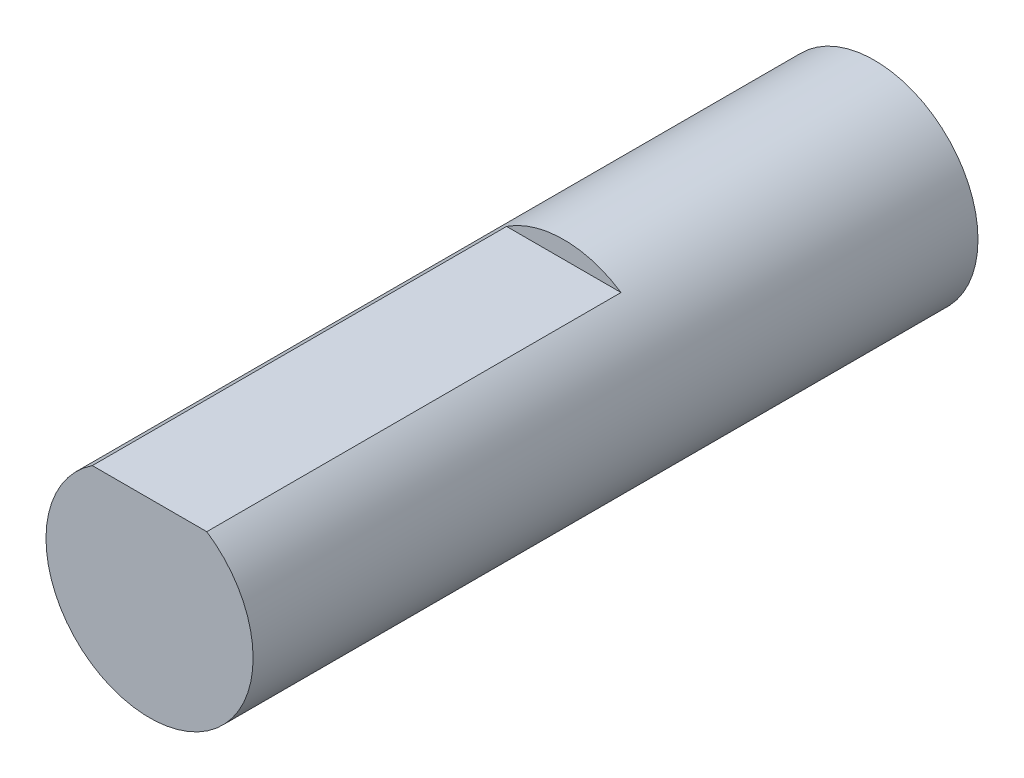
ISO-10303-21;
HEADER;
FILE_DESCRIPTION(('STEP AP214'),'2;1');
FILE_NAME('part.step','',(''),(''),'','','');
FILE_SCHEMA(('AUTOMOTIVE_DESIGN { 1 0 10303 214 1 1 1 1 }'));
ENDSEC;
DATA;
#1=APPLICATION_CONTEXT('core data for automotive mechanical design processes');
#2=APPLICATION_PROTOCOL_DEFINITION('international standard','automotive_design',2000,#1);
#3=PRODUCT_CONTEXT('',#1,'mechanical');
#4=PRODUCT('Part','Part','',(#3));
#5=PRODUCT_RELATED_PRODUCT_CATEGORY('part','',(#4));
#6=PRODUCT_DEFINITION_FORMATION('','',#4);
#7=PRODUCT_DEFINITION_CONTEXT('part definition',#1,'design');
#8=PRODUCT_DEFINITION('design','',#6,#7);
#9=PRODUCT_DEFINITION_SHAPE('','',#8);
#10=(LENGTH_UNIT() NAMED_UNIT(*) SI_UNIT(.MILLI.,.METRE.));
#11=(NAMED_UNIT(*) PLANE_ANGLE_UNIT() SI_UNIT($,.RADIAN.));
#12=(NAMED_UNIT(*) SI_UNIT($,.STERADIAN.) SOLID_ANGLE_UNIT());
#13=UNCERTAINTY_MEASURE_WITH_UNIT(LENGTH_MEASURE(1.E-05),#10,'distance_accuracy_value','');
#14=(GEOMETRIC_REPRESENTATION_CONTEXT(3) GLOBAL_UNCERTAINTY_ASSIGNED_CONTEXT((#13)) GLOBAL_UNIT_ASSIGNED_CONTEXT((#10,
#11,#12)) REPRESENTATION_CONTEXT('',''));
#15=CARTESIAN_POINT('',(0.,0.,0.));
#16=DIRECTION('',(0.,0.,1.));
#17=DIRECTION('',(1.,0.,0.));
#18=AXIS2_PLACEMENT_3D('',#15,#16,#17);
#19=CARTESIAN_POINT('',(0.,0.,21.));
#20=DIRECTION('',(0.,0.,-1.));
#21=DIRECTION('',(-1.,0.,0.));
#22=AXIS2_PLACEMENT_3D('',#19,#20,#21);
#23=CYLINDRICAL_SURFACE('',#22,3.);
#24=CARTESIAN_POINT('',(0.,0.,0.));
#25=DIRECTION('',(0.,0.,1.));
#26=DIRECTION('',(1.,0.,0.));
#27=AXIS2_PLACEMENT_3D('',#24,#25,#26);
#28=CIRCLE('',#27,3.);
#29=CARTESIAN_POINT('',(3.,0.,0.));
#30=VERTEX_POINT('',#29);
#31=EDGE_CURVE('E39',#30,#30,#28,.T.);
#32=ORIENTED_EDGE('',*,*,#31,.T.);
#33=EDGE_LOOP('',(#32));
#34=FACE_BOUND('',#33,.T.);
#35=DIRECTION('',(0.,0.,1.));
#36=VECTOR('',#35,1.);
#37=CARTESIAN_POINT('',(1.6583123951777,2.5,9.));
#38=LINE('',#37,#36);
#39=CARTESIAN_POINT('',(1.6583123951777,2.5,9.));
#40=VERTEX_POINT('',#39);
#41=CARTESIAN_POINT('',(1.6583123951777,2.5,21.));
#42=VERTEX_POINT('',#41);
#43=EDGE_CURVE('E56',#40,#42,#38,.T.);
#44=ORIENTED_EDGE('',*,*,#43,.T.);
#45=CARTESIAN_POINT('',(0.,0.,21.));
#46=DIRECTION('',(0.,0.,1.));
#47=DIRECTION('',(1.,0.,0.));
#48=AXIS2_PLACEMENT_3D('',#45,#46,#47);
#49=CIRCLE('',#48,3.);
#50=CARTESIAN_POINT('',(-1.6583123951777,2.5,21.));
#51=VERTEX_POINT('',#50);
#52=EDGE_CURVE('E11',#51,#42,#49,.T.);
#53=ORIENTED_EDGE('',*,*,#52,.F.);
#54=DIRECTION('',(0.,0.,1.));
#55=VECTOR('',#54,1.);
#56=CARTESIAN_POINT('',(-1.6583123951777,2.5,9.));
#57=LINE('',#56,#55);
#58=CARTESIAN_POINT('',(-1.6583123951777,2.5,9.));
#59=VERTEX_POINT('',#58);
#60=EDGE_CURVE('E50',#59,#51,#57,.T.);
#61=ORIENTED_EDGE('',*,*,#60,.F.);
#62=CARTESIAN_POINT('',(0.,0.,9.));
#63=DIRECTION('',(0.,0.,1.));
#64=DIRECTION('',(1.,0.,0.));
#65=AXIS2_PLACEMENT_3D('',#62,#63,#64);
#66=CIRCLE('',#65,3.);
#67=EDGE_CURVE('E64',#40,#59,#66,.T.);
#68=ORIENTED_EDGE('',*,*,#67,.F.);
#69=EDGE_LOOP('',(#44,#53,#61,#68));
#70=FACE_BOUND('',#69,.T.);
#71=ADVANCED_FACE('F36',(#34,#70),#23,.T.);
#72=CARTESIAN_POINT('',(0.,0.,21.));
#73=DIRECTION('',(0.,0.,1.));
#74=DIRECTION('',(1.,0.,0.));
#75=AXIS2_PLACEMENT_3D('',#72,#73,#74);
#76=PLANE('',#75);
#77=ORIENTED_EDGE('',*,*,#52,.T.);
#78=DIRECTION('',(-1.,0.,0.));
#79=VECTOR('',#78,1.);
#80=CARTESIAN_POINT('',(0.,2.5,21.));
#81=LINE('',#80,#79);
#82=EDGE_CURVE('E60',#42,#51,#81,.T.);
#83=ORIENTED_EDGE('',*,*,#82,.T.);
#84=EDGE_LOOP('',(#77,#83));
#85=FACE_BOUND('',#84,.T.);
#86=ADVANCED_FACE('F70',(#85),#76,.T.);
#87=CARTESIAN_POINT('',(0.,0.,0.));
#88=DIRECTION('',(0.,0.,1.));
#89=DIRECTION('',(1.,0.,0.));
#90=AXIS2_PLACEMENT_3D('',#87,#88,#89);
#91=PLANE('',#90);
#92=ORIENTED_EDGE('',*,*,#31,.F.);
#93=EDGE_LOOP('',(#92));
#94=FACE_BOUND('',#93,.T.);
#95=ADVANCED_FACE('F72',(#94),#91,.F.);
#96=CARTESIAN_POINT('',(0.,2.5,9.));
#97=DIRECTION('',(0.,1.,0.));
#98=DIRECTION('',(0.,0.,1.));
#99=AXIS2_PLACEMENT_3D('',#96,#97,#98);
#100=PLANE('',#99);
#101=ORIENTED_EDGE('',*,*,#82,.F.);
#102=ORIENTED_EDGE('',*,*,#43,.F.);
#103=DIRECTION('',(-1.,0.,0.));
#104=VECTOR('',#103,1.);
#105=CARTESIAN_POINT('',(0.,2.5,9.));
#106=LINE('',#105,#104);
#107=EDGE_CURVE('E88',#40,#59,#106,.T.);
#108=ORIENTED_EDGE('',*,*,#107,.T.);
#109=ORIENTED_EDGE('',*,*,#60,.T.);
#110=EDGE_LOOP('',(#101,#102,#108,#109));
#111=FACE_BOUND('',#110,.T.);
#112=ADVANCED_FACE('F61',(#111),#100,.T.);
#113=CARTESIAN_POINT('',(0.,0.,9.));
#114=DIRECTION('',(0.,0.,1.));
#115=DIRECTION('',(1.,0.,0.));
#116=AXIS2_PLACEMENT_3D('',#113,#114,#115);
#117=PLANE('',#116);
#118=ORIENTED_EDGE('',*,*,#67,.T.);
#119=ORIENTED_EDGE('',*,*,#107,.F.);
#120=EDGE_LOOP('',(#118,#119));
#121=FACE_BOUND('',#120,.T.);
#122=ADVANCED_FACE('F83',(#121),#117,.T.);
#123=CLOSED_SHELL('',(#71,#86,#95,#112,#122));
#124=MANIFOLD_SOLID_BREP('B2',#123);
#125=ADVANCED_BREP_SHAPE_REPRESENTATION('',(#18,#124),#14);
#126=SHAPE_DEFINITION_REPRESENTATION(#9,#125);
ENDSEC;
END-ISO-10303-21;
